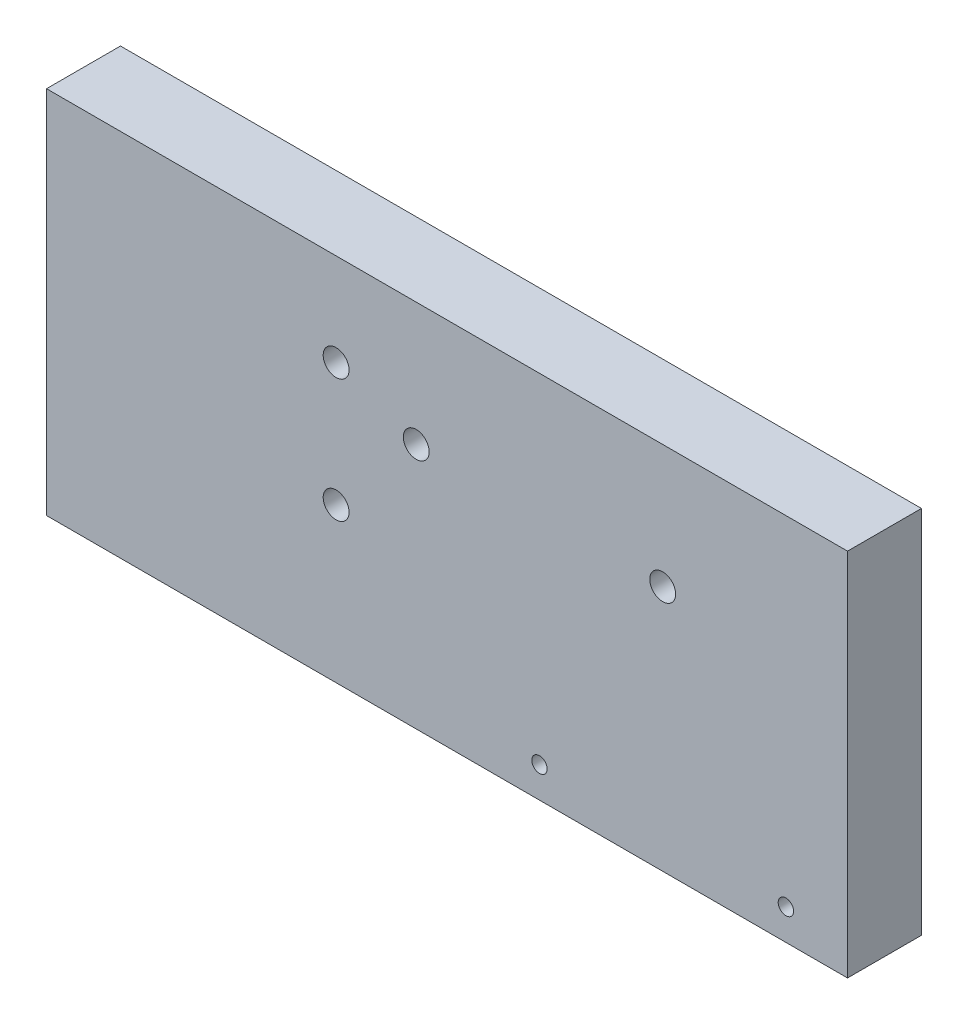
ISO-10303-21;
HEADER;
FILE_DESCRIPTION(('STEP AP214'),'2;1');
FILE_NAME('part.step','',(''),(''),'','','');
FILE_SCHEMA(('AUTOMOTIVE_DESIGN { 1 0 10303 214 1 1 1 1 }'));
ENDSEC;
DATA;
#1=APPLICATION_CONTEXT('core data for automotive mechanical design processes');
#2=APPLICATION_PROTOCOL_DEFINITION('international standard','automotive_design',2000,#1);
#3=PRODUCT_CONTEXT('',#1,'mechanical');
#4=PRODUCT('Part','Part','',(#3));
#5=PRODUCT_RELATED_PRODUCT_CATEGORY('part','',(#4));
#6=PRODUCT_DEFINITION_FORMATION('','',#4);
#7=PRODUCT_DEFINITION_CONTEXT('part definition',#1,'design');
#8=PRODUCT_DEFINITION('design','',#6,#7);
#9=PRODUCT_DEFINITION_SHAPE('','',#8);
#10=(LENGTH_UNIT() NAMED_UNIT(*) SI_UNIT(.MILLI.,.METRE.));
#11=(NAMED_UNIT(*) PLANE_ANGLE_UNIT() SI_UNIT($,.RADIAN.));
#12=(NAMED_UNIT(*) SI_UNIT($,.STERADIAN.) SOLID_ANGLE_UNIT());
#13=UNCERTAINTY_MEASURE_WITH_UNIT(LENGTH_MEASURE(1.E-05),#10,'distance_accuracy_value','');
#14=(GEOMETRIC_REPRESENTATION_CONTEXT(3) GLOBAL_UNCERTAINTY_ASSIGNED_CONTEXT((#13)) GLOBAL_UNIT_ASSIGNED_CONTEXT((#10,
#11,#12)) REPRESENTATION_CONTEXT('',''));
#15=CARTESIAN_POINT('',(0.,0.,0.));
#16=DIRECTION('',(0.,0.,1.));
#17=DIRECTION('',(1.,0.,0.));
#18=AXIS2_PLACEMENT_3D('',#15,#16,#17);
#19=CARTESIAN_POINT('',(65.,-30.,6.));
#20=DIRECTION('',(-1.,0.,0.));
#21=DIRECTION('',(0.,0.,1.));
#22=AXIS2_PLACEMENT_3D('',#19,#20,#21);
#23=PLANE('',#22);
#24=DIRECTION('',(0.,1.,0.));
#25=VECTOR('',#24,1.);
#26=CARTESIAN_POINT('',(65.,-30.,-6.));
#27=LINE('',#26,#25);
#28=CARTESIAN_POINT('',(65.,-30.,-6.));
#29=VERTEX_POINT('',#28);
#30=CARTESIAN_POINT('',(65.,30.,-6.));
#31=VERTEX_POINT('',#30);
#32=EDGE_CURVE('E102',#29,#31,#27,.T.);
#33=ORIENTED_EDGE('',*,*,#32,.T.);
#34=DIRECTION('',(0.,0.,-1.));
#35=VECTOR('',#34,1.);
#36=CARTESIAN_POINT('',(65.,30.,6.));
#37=LINE('',#36,#35);
#38=CARTESIAN_POINT('',(65.,30.,6.));
#39=VERTEX_POINT('',#38);
#40=EDGE_CURVE('E11',#39,#31,#37,.T.);
#41=ORIENTED_EDGE('',*,*,#40,.F.);
#42=DIRECTION('',(0.,1.,0.));
#43=VECTOR('',#42,1.);
#44=CARTESIAN_POINT('',(65.,-30.,6.));
#45=LINE('',#44,#43);
#46=CARTESIAN_POINT('',(65.,-30.,6.));
#47=VERTEX_POINT('',#46);
#48=EDGE_CURVE('E90',#47,#39,#45,.T.);
#49=ORIENTED_EDGE('',*,*,#48,.F.);
#50=DIRECTION('',(0.,0.,-1.));
#51=VECTOR('',#50,1.);
#52=CARTESIAN_POINT('',(65.,-30.,6.));
#53=LINE('',#52,#51);
#54=EDGE_CURVE('E98',#47,#29,#53,.T.);
#55=ORIENTED_EDGE('',*,*,#54,.T.);
#56=EDGE_LOOP('',(#33,#41,#49,#55));
#57=FACE_BOUND('',#56,.T.);
#58=ADVANCED_FACE('F39',(#57),#23,.F.);
#59=CARTESIAN_POINT('',(-65.,30.,6.));
#60=DIRECTION('',(0.,-1.,0.));
#61=DIRECTION('',(0.,0.,-1.));
#62=AXIS2_PLACEMENT_3D('',#59,#60,#61);
#63=PLANE('',#62);
#64=DIRECTION('',(-1.,0.,0.));
#65=VECTOR('',#64,1.);
#66=CARTESIAN_POINT('',(-65.,30.,-6.));
#67=LINE('',#66,#65);
#68=CARTESIAN_POINT('',(-65.,30.,-6.));
#69=VERTEX_POINT('',#68);
#70=EDGE_CURVE('E94',#31,#69,#67,.T.);
#71=ORIENTED_EDGE('',*,*,#70,.T.);
#72=DIRECTION('',(0.,0.,-1.));
#73=VECTOR('',#72,1.);
#74=CARTESIAN_POINT('',(-65.,30.,6.));
#75=LINE('',#74,#73);
#76=CARTESIAN_POINT('',(-65.,30.,6.));
#77=VERTEX_POINT('',#76);
#78=EDGE_CURVE('E47',#77,#69,#75,.T.);
#79=ORIENTED_EDGE('',*,*,#78,.F.);
#80=DIRECTION('',(-1.,0.,0.));
#81=VECTOR('',#80,1.);
#82=CARTESIAN_POINT('',(-65.,30.,6.));
#83=LINE('',#82,#81);
#84=EDGE_CURVE('E85',#39,#77,#83,.T.);
#85=ORIENTED_EDGE('',*,*,#84,.F.);
#86=ORIENTED_EDGE('',*,*,#40,.T.);
#87=EDGE_LOOP('',(#71,#79,#85,#86));
#88=FACE_BOUND('',#87,.T.);
#89=ADVANCED_FACE('F93',(#88),#63,.F.);
#90=CARTESIAN_POINT('',(-65.,-30.,6.));
#91=DIRECTION('',(1.,0.,0.));
#92=DIRECTION('',(0.,0.,-1.));
#93=AXIS2_PLACEMENT_3D('',#90,#91,#92);
#94=PLANE('',#93);
#95=DIRECTION('',(0.,-1.,0.));
#96=VECTOR('',#95,1.);
#97=CARTESIAN_POINT('',(-65.,-30.,-6.));
#98=LINE('',#97,#96);
#99=CARTESIAN_POINT('',(-65.,-30.,-6.));
#100=VERTEX_POINT('',#99);
#101=EDGE_CURVE('E72',#69,#100,#98,.T.);
#102=ORIENTED_EDGE('',*,*,#101,.T.);
#103=DIRECTION('',(0.,0.,-1.));
#104=VECTOR('',#103,1.);
#105=CARTESIAN_POINT('',(-65.,-30.,6.));
#106=LINE('',#105,#104);
#107=CARTESIAN_POINT('',(-65.,-30.,6.));
#108=VERTEX_POINT('',#107);
#109=EDGE_CURVE('E95',#108,#100,#106,.T.);
#110=ORIENTED_EDGE('',*,*,#109,.F.);
#111=DIRECTION('',(0.,-1.,0.));
#112=VECTOR('',#111,1.);
#113=CARTESIAN_POINT('',(-65.,-30.,6.));
#114=LINE('',#113,#112);
#115=EDGE_CURVE('E88',#77,#108,#114,.T.);
#116=ORIENTED_EDGE('',*,*,#115,.F.);
#117=ORIENTED_EDGE('',*,*,#78,.T.);
#118=EDGE_LOOP('',(#102,#110,#116,#117));
#119=FACE_BOUND('',#118,.T.);
#120=ADVANCED_FACE('F96',(#119),#94,.F.);
#121=CARTESIAN_POINT('',(-65.,-30.,6.));
#122=DIRECTION('',(0.,1.,0.));
#123=DIRECTION('',(0.,0.,1.));
#124=AXIS2_PLACEMENT_3D('',#121,#122,#123);
#125=PLANE('',#124);
#126=DIRECTION('',(1.,0.,0.));
#127=VECTOR('',#126,1.);
#128=CARTESIAN_POINT('',(-65.,-30.,-6.));
#129=LINE('',#128,#127);
#130=EDGE_CURVE('E78',#100,#29,#129,.T.);
#131=ORIENTED_EDGE('',*,*,#130,.T.);
#132=ORIENTED_EDGE('',*,*,#54,.F.);
#133=DIRECTION('',(1.,0.,0.));
#134=VECTOR('',#133,1.);
#135=CARTESIAN_POINT('',(-65.,-30.,6.));
#136=LINE('',#135,#134);
#137=EDGE_CURVE('E55',#108,#47,#136,.T.);
#138=ORIENTED_EDGE('',*,*,#137,.F.);
#139=ORIENTED_EDGE('',*,*,#109,.T.);
#140=EDGE_LOOP('',(#131,#132,#138,#139));
#141=FACE_BOUND('',#140,.T.);
#142=ADVANCED_FACE('F110',(#141),#125,.F.);
#143=CARTESIAN_POINT('',(0.,0.,6.));
#144=DIRECTION('',(0.,0.,-1.));
#145=DIRECTION('',(-1.,0.,0.));
#146=AXIS2_PLACEMENT_3D('',#143,#144,#145);
#147=PLANE('',#146);
#148=CARTESIAN_POINT('',(15.,-25.,6.));
#149=DIRECTION('',(0.,0.,1.));
#150=DIRECTION('',(1.,0.,0.));
#151=AXIS2_PLACEMENT_3D('',#148,#149,#150);
#152=CIRCLE('',#151,1.25);
#153=CARTESIAN_POINT('',(16.25,-25.,6.));
#154=VERTEX_POINT('',#153);
#155=EDGE_CURVE('E148',#154,#154,#152,.T.);
#156=ORIENTED_EDGE('',*,*,#155,.F.);
#157=EDGE_LOOP('',(#156));
#158=FACE_BOUND('',#157,.T.);
#159=CARTESIAN_POINT('',(55.,-25.,6.));
#160=DIRECTION('',(0.,0.,1.));
#161=DIRECTION('',(1.,0.,0.));
#162=AXIS2_PLACEMENT_3D('',#159,#160,#161);
#163=CIRCLE('',#162,1.25);
#164=CARTESIAN_POINT('',(56.25,-25.,6.));
#165=VERTEX_POINT('',#164);
#166=EDGE_CURVE('E142',#165,#165,#163,.T.);
#167=ORIENTED_EDGE('',*,*,#166,.F.);
#168=EDGE_LOOP('',(#167));
#169=FACE_BOUND('',#168,.T.);
#170=CARTESIAN_POINT('',(-18.,15.,6.));
#171=DIRECTION('',(0.,0.,1.));
#172=DIRECTION('',(1.,0.,0.));
#173=AXIS2_PLACEMENT_3D('',#170,#171,#172);
#174=CIRCLE('',#173,2.09999999999999);
#175=CARTESIAN_POINT('',(-15.9,15.,6.));
#176=VERTEX_POINT('',#175);
#177=EDGE_CURVE('E136',#176,#176,#174,.T.);
#178=ORIENTED_EDGE('',*,*,#177,.F.);
#179=EDGE_LOOP('',(#178));
#180=FACE_BOUND('',#179,.T.);
#181=CARTESIAN_POINT('',(-18.,-5.,6.));
#182=DIRECTION('',(0.,0.,1.));
#183=DIRECTION('',(1.,0.,0.));
#184=AXIS2_PLACEMENT_3D('',#181,#182,#183);
#185=CIRCLE('',#184,2.09999999999999);
#186=CARTESIAN_POINT('',(-15.9,-5.,6.));
#187=VERTEX_POINT('',#186);
#188=EDGE_CURVE('E130',#187,#187,#185,.T.);
#189=ORIENTED_EDGE('',*,*,#188,.F.);
#190=EDGE_LOOP('',(#189));
#191=FACE_BOUND('',#190,.T.);
#192=CARTESIAN_POINT('',(-5.,10.,6.));
#193=DIRECTION('',(0.,0.,1.));
#194=DIRECTION('',(1.,0.,0.));
#195=AXIS2_PLACEMENT_3D('',#192,#193,#194);
#196=CIRCLE('',#195,2.09999999999999);
#197=CARTESIAN_POINT('',(-2.90000000000001,10.,6.));
#198=VERTEX_POINT('',#197);
#199=EDGE_CURVE('E124',#198,#198,#196,.T.);
#200=ORIENTED_EDGE('',*,*,#199,.F.);
#201=EDGE_LOOP('',(#200));
#202=FACE_BOUND('',#201,.T.);
#203=CARTESIAN_POINT('',(35.,10.,6.));
#204=DIRECTION('',(0.,0.,1.));
#205=DIRECTION('',(1.,0.,0.));
#206=AXIS2_PLACEMENT_3D('',#203,#204,#205);
#207=CIRCLE('',#206,2.09999999999999);
#208=CARTESIAN_POINT('',(37.1,10.,6.));
#209=VERTEX_POINT('',#208);
#210=EDGE_CURVE('E118',#209,#209,#207,.T.);
#211=ORIENTED_EDGE('',*,*,#210,.F.);
#212=EDGE_LOOP('',(#211));
#213=FACE_BOUND('',#212,.T.);
#214=ORIENTED_EDGE('',*,*,#48,.T.);
#215=ORIENTED_EDGE('',*,*,#84,.T.);
#216=ORIENTED_EDGE('',*,*,#115,.T.);
#217=ORIENTED_EDGE('',*,*,#137,.T.);
#218=EDGE_LOOP('',(#214,#215,#216,#217));
#219=FACE_BOUND('',#218,.T.);
#220=ADVANCED_FACE('F86',(#158,#169,#180,#191,#202,#213,#219),#147,.F.);
#221=CARTESIAN_POINT('',(0.,0.,-6.));
#222=DIRECTION('',(0.,0.,-1.));
#223=DIRECTION('',(-1.,0.,0.));
#224=AXIS2_PLACEMENT_3D('',#221,#222,#223);
#225=PLANE('',#224);
#226=CARTESIAN_POINT('',(15.,-25.,-6.));
#227=DIRECTION('',(0.,0.,1.));
#228=DIRECTION('',(1.,0.,0.));
#229=AXIS2_PLACEMENT_3D('',#226,#227,#228);
#230=CIRCLE('',#229,1.25);
#231=CARTESIAN_POINT('',(16.25,-25.,-6.));
#232=VERTEX_POINT('',#231);
#233=EDGE_CURVE('E145',#232,#232,#230,.T.);
#234=ORIENTED_EDGE('',*,*,#233,.T.);
#235=EDGE_LOOP('',(#234));
#236=FACE_BOUND('',#235,.T.);
#237=CARTESIAN_POINT('',(55.,-25.,-6.));
#238=DIRECTION('',(0.,0.,1.));
#239=DIRECTION('',(1.,0.,0.));
#240=AXIS2_PLACEMENT_3D('',#237,#238,#239);
#241=CIRCLE('',#240,1.24999999999999);
#242=CARTESIAN_POINT('',(56.25,-25.,-6.));
#243=VERTEX_POINT('',#242);
#244=EDGE_CURVE('E139',#243,#243,#241,.T.);
#245=ORIENTED_EDGE('',*,*,#244,.T.);
#246=EDGE_LOOP('',(#245));
#247=FACE_BOUND('',#246,.T.);
#248=CARTESIAN_POINT('',(-18.,15.,-6.));
#249=DIRECTION('',(0.,0.,1.));
#250=DIRECTION('',(1.,0.,0.));
#251=AXIS2_PLACEMENT_3D('',#248,#249,#250);
#252=CIRCLE('',#251,2.1);
#253=CARTESIAN_POINT('',(-15.9,15.,-6.));
#254=VERTEX_POINT('',#253);
#255=EDGE_CURVE('E133',#254,#254,#252,.T.);
#256=ORIENTED_EDGE('',*,*,#255,.T.);
#257=EDGE_LOOP('',(#256));
#258=FACE_BOUND('',#257,.T.);
#259=CARTESIAN_POINT('',(-18.,-5.,-6.));
#260=DIRECTION('',(0.,0.,1.));
#261=DIRECTION('',(1.,0.,0.));
#262=AXIS2_PLACEMENT_3D('',#259,#260,#261);
#263=CIRCLE('',#262,2.1);
#264=CARTESIAN_POINT('',(-15.9,-5.,-6.));
#265=VERTEX_POINT('',#264);
#266=EDGE_CURVE('E127',#265,#265,#263,.T.);
#267=ORIENTED_EDGE('',*,*,#266,.T.);
#268=EDGE_LOOP('',(#267));
#269=FACE_BOUND('',#268,.T.);
#270=CARTESIAN_POINT('',(-5.,10.,-6.));
#271=DIRECTION('',(0.,0.,1.));
#272=DIRECTION('',(1.,0.,0.));
#273=AXIS2_PLACEMENT_3D('',#270,#271,#272);
#274=CIRCLE('',#273,2.1);
#275=CARTESIAN_POINT('',(-2.9,10.,-6.));
#276=VERTEX_POINT('',#275);
#277=EDGE_CURVE('E121',#276,#276,#274,.T.);
#278=ORIENTED_EDGE('',*,*,#277,.T.);
#279=EDGE_LOOP('',(#278));
#280=FACE_BOUND('',#279,.T.);
#281=CARTESIAN_POINT('',(35.,10.,-6.));
#282=DIRECTION('',(0.,0.,1.));
#283=DIRECTION('',(1.,0.,0.));
#284=AXIS2_PLACEMENT_3D('',#281,#282,#283);
#285=CIRCLE('',#284,2.1);
#286=CARTESIAN_POINT('',(37.1,10.,-6.));
#287=VERTEX_POINT('',#286);
#288=EDGE_CURVE('E105',#287,#287,#285,.T.);
#289=ORIENTED_EDGE('',*,*,#288,.T.);
#290=EDGE_LOOP('',(#289));
#291=FACE_BOUND('',#290,.T.);
#292=ORIENTED_EDGE('',*,*,#32,.F.);
#293=ORIENTED_EDGE('',*,*,#130,.F.);
#294=ORIENTED_EDGE('',*,*,#101,.F.);
#295=ORIENTED_EDGE('',*,*,#70,.F.);
#296=EDGE_LOOP('',(#292,#293,#294,#295));
#297=FACE_BOUND('',#296,.T.);
#298=ADVANCED_FACE('F113',(#236,#247,#258,#269,#280,#291,#297),#225,.T.);
#299=CARTESIAN_POINT('',(35.,10.,6.));
#300=DIRECTION('',(0.,0.,1.));
#301=DIRECTION('',(1.,0.,0.));
#302=AXIS2_PLACEMENT_3D('',#299,#300,#301);
#303=CYLINDRICAL_SURFACE('',#302,2.09999999999999);
#304=ORIENTED_EDGE('',*,*,#288,.F.);
#305=EDGE_LOOP('',(#304));
#306=FACE_BOUND('',#305,.T.);
#307=ORIENTED_EDGE('',*,*,#210,.T.);
#308=EDGE_LOOP('',(#307));
#309=FACE_BOUND('',#308,.T.);
#310=ADVANCED_FACE('F167',(#306,#309),#303,.F.);
#311=CARTESIAN_POINT('',(-5.,10.,6.));
#312=DIRECTION('',(0.,0.,1.));
#313=DIRECTION('',(1.,0.,0.));
#314=AXIS2_PLACEMENT_3D('',#311,#312,#313);
#315=CYLINDRICAL_SURFACE('',#314,2.09999999999999);
#316=ORIENTED_EDGE('',*,*,#277,.F.);
#317=EDGE_LOOP('',(#316));
#318=FACE_BOUND('',#317,.T.);
#319=ORIENTED_EDGE('',*,*,#199,.T.);
#320=EDGE_LOOP('',(#319));
#321=FACE_BOUND('',#320,.T.);
#322=ADVANCED_FACE('F169',(#318,#321),#315,.F.);
#323=CARTESIAN_POINT('',(-18.,-5.,6.));
#324=DIRECTION('',(0.,0.,1.));
#325=DIRECTION('',(1.,0.,0.));
#326=AXIS2_PLACEMENT_3D('',#323,#324,#325);
#327=CYLINDRICAL_SURFACE('',#326,2.09999999999999);
#328=ORIENTED_EDGE('',*,*,#266,.F.);
#329=EDGE_LOOP('',(#328));
#330=FACE_BOUND('',#329,.T.);
#331=ORIENTED_EDGE('',*,*,#188,.T.);
#332=EDGE_LOOP('',(#331));
#333=FACE_BOUND('',#332,.T.);
#334=ADVANCED_FACE('F176',(#330,#333),#327,.F.);
#335=CARTESIAN_POINT('',(-18.,15.,6.));
#336=DIRECTION('',(0.,0.,1.));
#337=DIRECTION('',(1.,0.,0.));
#338=AXIS2_PLACEMENT_3D('',#335,#336,#337);
#339=CYLINDRICAL_SURFACE('',#338,2.09999999999999);
#340=ORIENTED_EDGE('',*,*,#255,.F.);
#341=EDGE_LOOP('',(#340));
#342=FACE_BOUND('',#341,.T.);
#343=ORIENTED_EDGE('',*,*,#177,.T.);
#344=EDGE_LOOP('',(#343));
#345=FACE_BOUND('',#344,.T.);
#346=ADVANCED_FACE('F223',(#342,#345),#339,.F.);
#347=CARTESIAN_POINT('',(55.,-25.,6.));
#348=DIRECTION('',(0.,0.,1.));
#349=DIRECTION('',(1.,0.,0.));
#350=AXIS2_PLACEMENT_3D('',#347,#348,#349);
#351=CYLINDRICAL_SURFACE('',#350,1.25);
#352=ORIENTED_EDGE('',*,*,#244,.F.);
#353=EDGE_LOOP('',(#352));
#354=FACE_BOUND('',#353,.T.);
#355=ORIENTED_EDGE('',*,*,#166,.T.);
#356=EDGE_LOOP('',(#355));
#357=FACE_BOUND('',#356,.T.);
#358=ADVANCED_FACE('F217',(#354,#357),#351,.F.);
#359=CARTESIAN_POINT('',(15.,-25.,6.));
#360=DIRECTION('',(0.,0.,1.));
#361=DIRECTION('',(1.,0.,0.));
#362=AXIS2_PLACEMENT_3D('',#359,#360,#361);
#363=CYLINDRICAL_SURFACE('',#362,1.25);
#364=ORIENTED_EDGE('',*,*,#233,.F.);
#365=EDGE_LOOP('',(#364));
#366=FACE_BOUND('',#365,.T.);
#367=ORIENTED_EDGE('',*,*,#155,.T.);
#368=EDGE_LOOP('',(#367));
#369=FACE_BOUND('',#368,.T.);
#370=ADVANCED_FACE('F152',(#366,#369),#363,.F.);
#371=CLOSED_SHELL('',(#58,#89,#120,#142,#220,#298,#310,#322,#334,#346,#358,#370));
#372=MANIFOLD_SOLID_BREP('B2',#371);
#373=ADVANCED_BREP_SHAPE_REPRESENTATION('',(#18,#372),#14);
#374=SHAPE_DEFINITION_REPRESENTATION(#9,#373);
ENDSEC;
END-ISO-10303-21;
